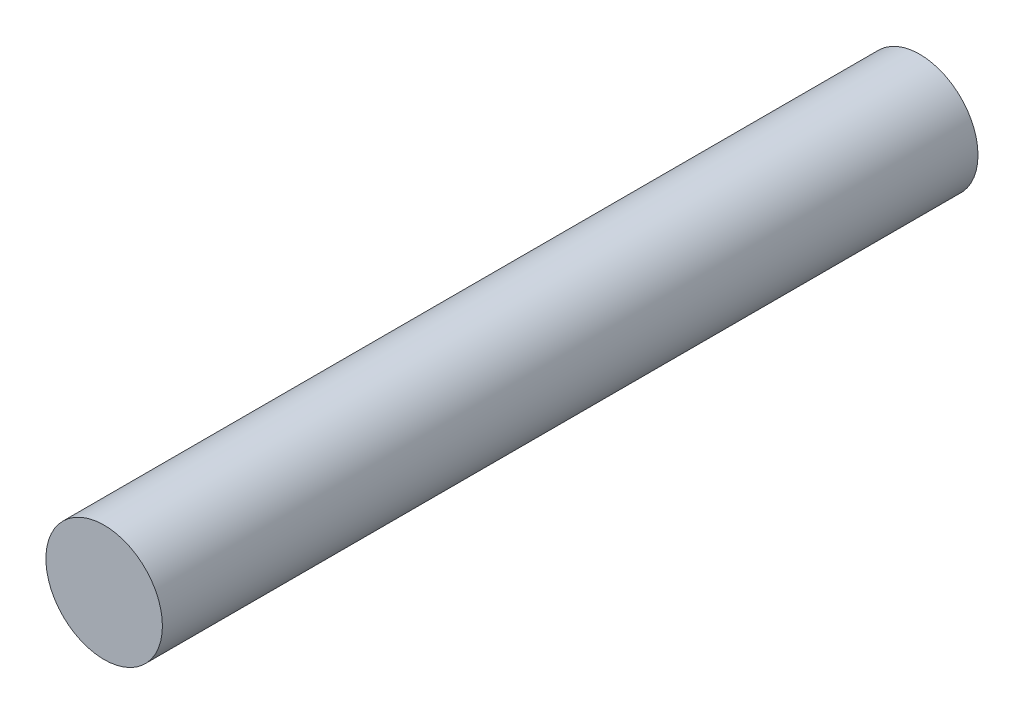
ISO-10303-21;
HEADER;
FILE_DESCRIPTION(('STEP AP214'),'2;1');
FILE_NAME('part.step','',(''),(''),'','','');
FILE_SCHEMA(('AUTOMOTIVE_DESIGN { 1 0 10303 214 1 1 1 1 }'));
ENDSEC;
DATA;
#1=APPLICATION_CONTEXT('core data for automotive mechanical design processes');
#2=APPLICATION_PROTOCOL_DEFINITION('international standard','automotive_design',2000,#1);
#3=PRODUCT_CONTEXT('',#1,'mechanical');
#4=PRODUCT('Part','Part','',(#3));
#5=PRODUCT_RELATED_PRODUCT_CATEGORY('part','',(#4));
#6=PRODUCT_DEFINITION_FORMATION('','',#4);
#7=PRODUCT_DEFINITION_CONTEXT('part definition',#1,'design');
#8=PRODUCT_DEFINITION('design','',#6,#7);
#9=PRODUCT_DEFINITION_SHAPE('','',#8);
#10=(LENGTH_UNIT() NAMED_UNIT(*) SI_UNIT(.MILLI.,.METRE.));
#11=(NAMED_UNIT(*) PLANE_ANGLE_UNIT() SI_UNIT($,.RADIAN.));
#12=(NAMED_UNIT(*) SI_UNIT($,.STERADIAN.) SOLID_ANGLE_UNIT());
#13=UNCERTAINTY_MEASURE_WITH_UNIT(LENGTH_MEASURE(1.E-05),#10,'distance_accuracy_value','');
#14=(GEOMETRIC_REPRESENTATION_CONTEXT(3) GLOBAL_UNCERTAINTY_ASSIGNED_CONTEXT((#13)) GLOBAL_UNIT_ASSIGNED_CONTEXT((#10,
#11,#12)) REPRESENTATION_CONTEXT('',''));
#15=CARTESIAN_POINT('',(0.,0.,0.));
#16=DIRECTION('',(0.,0.,1.));
#17=DIRECTION('',(1.,0.,0.));
#18=AXIS2_PLACEMENT_3D('',#15,#16,#17);
#19=CARTESIAN_POINT('',(0.,0.,88.9));
#20=DIRECTION('',(0.,0.,-1.));
#21=DIRECTION('',(-1.,0.,0.));
#22=AXIS2_PLACEMENT_3D('',#19,#20,#21);
#23=CYLINDRICAL_SURFACE('',#22,6.35);
#24=CARTESIAN_POINT('',(0.,0.,88.9));
#25=DIRECTION('',(0.,0.,1.));
#26=DIRECTION('',(1.,0.,0.));
#27=AXIS2_PLACEMENT_3D('',#24,#25,#26);
#28=CIRCLE('',#27,6.35);
#29=CARTESIAN_POINT('',(6.35,0.,88.9));
#30=VERTEX_POINT('',#29);
#31=EDGE_CURVE('E10',#30,#30,#28,.T.);
#32=ORIENTED_EDGE('',*,*,#31,.F.);
#33=EDGE_LOOP('',(#32));
#34=FACE_BOUND('',#33,.T.);
#35=CARTESIAN_POINT('',(0.,0.,0.));
#36=DIRECTION('',(0.,0.,1.));
#37=DIRECTION('',(1.,0.,0.));
#38=AXIS2_PLACEMENT_3D('',#35,#36,#37);
#39=CIRCLE('',#38,6.35);
#40=CARTESIAN_POINT('',(6.35,0.,0.));
#41=VERTEX_POINT('',#40);
#42=EDGE_CURVE('E34',#41,#41,#39,.T.);
#43=ORIENTED_EDGE('',*,*,#42,.T.);
#44=EDGE_LOOP('',(#43));
#45=FACE_BOUND('',#44,.T.);
#46=ADVANCED_FACE('F31',(#34,#45),#23,.T.);
#47=CARTESIAN_POINT('',(0.,0.,88.9));
#48=DIRECTION('',(0.,0.,1.));
#49=DIRECTION('',(1.,0.,0.));
#50=AXIS2_PLACEMENT_3D('',#47,#48,#49);
#51=PLANE('',#50);
#52=ORIENTED_EDGE('',*,*,#31,.T.);
#53=EDGE_LOOP('',(#52));
#54=FACE_BOUND('',#53,.T.);
#55=ADVANCED_FACE('F46',(#54),#51,.T.);
#56=CARTESIAN_POINT('',(0.,0.,0.));
#57=DIRECTION('',(0.,0.,1.));
#58=DIRECTION('',(1.,0.,0.));
#59=AXIS2_PLACEMENT_3D('',#56,#57,#58);
#60=PLANE('',#59);
#61=ORIENTED_EDGE('',*,*,#42,.F.);
#62=EDGE_LOOP('',(#61));
#63=FACE_BOUND('',#62,.T.);
#64=ADVANCED_FACE('F44',(#63),#60,.F.);
#65=CLOSED_SHELL('',(#46,#55,#64));
#66=MANIFOLD_SOLID_BREP('B2',#65);
#67=ADVANCED_BREP_SHAPE_REPRESENTATION('',(#18,#66),#14);
#68=SHAPE_DEFINITION_REPRESENTATION(#9,#67);
ENDSEC;
END-ISO-10303-21;
